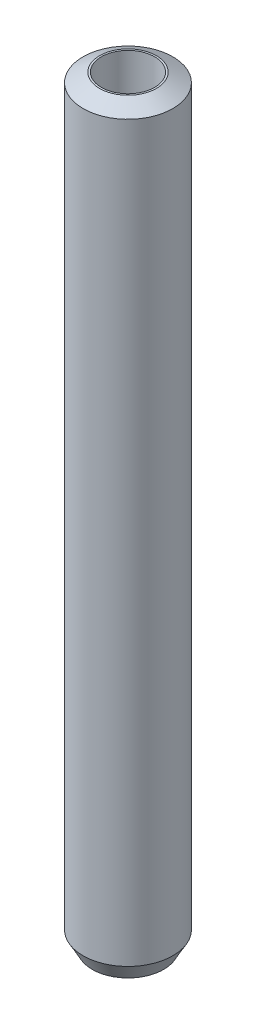
ISO-10303-21;
HEADER;
FILE_DESCRIPTION(('STEP AP214'),'2;1');
FILE_NAME('part.step','',(''),(''),'','','');
FILE_SCHEMA(('AUTOMOTIVE_DESIGN { 1 0 10303 214 1 1 1 1 }'));
ENDSEC;
DATA;
#1=APPLICATION_CONTEXT('core data for automotive mechanical design processes');
#2=APPLICATION_PROTOCOL_DEFINITION('international standard','automotive_design',2000,#1);
#3=PRODUCT_CONTEXT('',#1,'mechanical');
#4=PRODUCT('Part','Part','',(#3));
#5=PRODUCT_RELATED_PRODUCT_CATEGORY('part','',(#4));
#6=PRODUCT_DEFINITION_FORMATION('','',#4);
#7=PRODUCT_DEFINITION_CONTEXT('part definition',#1,'design');
#8=PRODUCT_DEFINITION('design','',#6,#7);
#9=PRODUCT_DEFINITION_SHAPE('','',#8);
#10=(LENGTH_UNIT() NAMED_UNIT(*) SI_UNIT(.MILLI.,.METRE.));
#11=(NAMED_UNIT(*) PLANE_ANGLE_UNIT() SI_UNIT($,.RADIAN.));
#12=(NAMED_UNIT(*) SI_UNIT($,.STERADIAN.) SOLID_ANGLE_UNIT());
#13=UNCERTAINTY_MEASURE_WITH_UNIT(LENGTH_MEASURE(1.E-05),#10,'distance_accuracy_value','');
#14=(GEOMETRIC_REPRESENTATION_CONTEXT(3) GLOBAL_UNCERTAINTY_ASSIGNED_CONTEXT((#13)) GLOBAL_UNIT_ASSIGNED_CONTEXT((#10,
#11,#12)) REPRESENTATION_CONTEXT('',''));
#15=CARTESIAN_POINT('',(0.,0.,0.));
#16=DIRECTION('',(0.,0.,1.));
#17=DIRECTION('',(1.,0.,0.));
#18=AXIS2_PLACEMENT_3D('',#15,#16,#17);
#19=CARTESIAN_POINT('',(0.,422.888548460938,0.));
#20=DIRECTION('',(0.,-1.,0.));
#21=DIRECTION('',(0.,0.,-1.));
#22=AXIS2_PLACEMENT_3D('',#19,#20,#21);
#23=CYLINDRICAL_SURFACE('',#22,25.);
#24=CARTESIAN_POINT('',(0.,417.786648525233,0.));
#25=DIRECTION('',(0.,1.,0.));
#26=DIRECTION('',(0.,0.,1.));
#27=AXIS2_PLACEMENT_3D('',#24,#25,#26);
#28=CIRCLE('',#27,25.);
#29=CARTESIAN_POINT('',(0.,417.786648525233,25.));
#30=VERTEX_POINT('',#29);
#31=EDGE_CURVE('E50',#30,#30,#28,.F.);
#32=ORIENTED_EDGE('',*,*,#31,.T.);
#33=EDGE_LOOP('',(#32));
#34=FACE_BOUND('',#33,.T.);
#35=CARTESIAN_POINT('',(0.,9.17434554495294,0.));
#36=DIRECTION('',(0.,1.,0.));
#37=DIRECTION('',(0.,0.,1.));
#38=AXIS2_PLACEMENT_3D('',#35,#36,#37);
#39=CIRCLE('',#38,25.);
#40=CARTESIAN_POINT('',(0.,9.17434554495294,25.));
#41=VERTEX_POINT('',#40);
#42=EDGE_CURVE('E51',#41,#41,#39,.T.);
#43=ORIENTED_EDGE('',*,*,#42,.T.);
#44=EDGE_LOOP('',(#43));
#45=FACE_BOUND('',#44,.T.);
#46=ADVANCED_FACE('F39',(#34,#45),#23,.T.);
#47=CARTESIAN_POINT('',(0.,422.888548460938,0.));
#48=DIRECTION('',(0.,1.,0.));
#49=DIRECTION('',(0.,0.,1.));
#50=AXIS2_PLACEMENT_3D('',#47,#48,#49);
#51=PLANE('',#50);
#52=CARTESIAN_POINT('',(0.,422.888548460938,0.));
#53=DIRECTION('',(0.,1.,0.));
#54=DIRECTION('',(0.,0.,1.));
#55=AXIS2_PLACEMENT_3D('',#52,#53,#54);
#56=CIRCLE('',#55,15.825654455047);
#57=CARTESIAN_POINT('',(0.,422.888548460938,15.825654455047));
#58=VERTEX_POINT('',#57);
#59=EDGE_CURVE('E54',#58,#58,#56,.T.);
#60=ORIENTED_EDGE('',*,*,#59,.T.);
#61=EDGE_LOOP('',(#60));
#62=FACE_BOUND('',#61,.T.);
#63=CARTESIAN_POINT('',(0.,422.888548460938,0.));
#64=DIRECTION('',(0.,1.,0.));
#65=DIRECTION('',(0.,0.,1.));
#66=AXIS2_PLACEMENT_3D('',#63,#64,#65);
#67=CIRCLE('',#66,14.8225800597742);
#68=CARTESIAN_POINT('',(0.,422.888548460938,14.8225800597742));
#69=VERTEX_POINT('',#68);
#70=EDGE_CURVE('E58',#69,#69,#67,.T.);
#71=ORIENTED_EDGE('',*,*,#70,.F.);
#72=EDGE_LOOP('',(#71));
#73=FACE_BOUND('',#72,.T.);
#74=ADVANCED_FACE('F69',(#62,#73),#51,.T.);
#75=CARTESIAN_POINT('',(0.,0.,0.));
#76=DIRECTION('',(0.,1.,0.));
#77=DIRECTION('',(0.,0.,1.));
#78=AXIS2_PLACEMENT_3D('',#75,#76,#77);
#79=PLANE('',#78);
#80=CARTESIAN_POINT('',(0.,0.,0.));
#81=DIRECTION('',(0.,1.,0.));
#82=DIRECTION('',(0.,0.,1.));
#83=AXIS2_PLACEMENT_3D('',#80,#81,#82);
#84=CIRCLE('',#83,19.8981000642956);
#85=CARTESIAN_POINT('',(0.,0.,19.8981000642956));
#86=VERTEX_POINT('',#85);
#87=EDGE_CURVE('E10',#86,#86,#84,.F.);
#88=ORIENTED_EDGE('',*,*,#87,.T.);
#89=EDGE_LOOP('',(#88));
#90=FACE_BOUND('',#89,.T.);
#91=CARTESIAN_POINT('',(0.,0.,0.));
#92=DIRECTION('',(0.,1.,0.));
#93=DIRECTION('',(0.,0.,1.));
#94=AXIS2_PLACEMENT_3D('',#91,#92,#93);
#95=CIRCLE('',#94,14.8225800597742);
#96=CARTESIAN_POINT('',(0.,0.,14.8225800597742));
#97=VERTEX_POINT('',#96);
#98=EDGE_CURVE('E63',#97,#97,#95,.T.);
#99=ORIENTED_EDGE('',*,*,#98,.T.);
#100=EDGE_LOOP('',(#99));
#101=FACE_BOUND('',#100,.T.);
#102=ADVANCED_FACE('F75',(#90,#101),#79,.F.);
#103=CARTESIAN_POINT('',(0.,422.888548460938,0.));
#104=DIRECTION('',(0.,-1.,0.));
#105=DIRECTION('',(0.,0.,-1.));
#106=AXIS2_PLACEMENT_3D('',#103,#104,#105);
#107=CYLINDRICAL_SURFACE('',#106,14.8225800597742);
#108=ORIENTED_EDGE('',*,*,#70,.T.);
#109=EDGE_LOOP('',(#108));
#110=FACE_BOUND('',#109,.T.);
#111=ORIENTED_EDGE('',*,*,#98,.F.);
#112=EDGE_LOOP('',(#111));
#113=FACE_BOUND('',#112,.T.);
#114=ADVANCED_FACE('F70',(#110,#113),#107,.F.);
#115=CARTESIAN_POINT('',(0.,422.888548460938,0.));
#116=DIRECTION('',(0.,-1.,0.));
#117=DIRECTION('',(0.,0.,-1.));
#118=AXIS2_PLACEMENT_3D('',#115,#116,#117);
#119=CONICAL_SURFACE('',#118,15.825654455047,1.06327801968595);
#120=ORIENTED_EDGE('',*,*,#31,.F.);
#121=EDGE_LOOP('',(#120));
#122=FACE_BOUND('',#121,.T.);
#123=ORIENTED_EDGE('',*,*,#59,.F.);
#124=EDGE_LOOP('',(#123));
#125=FACE_BOUND('',#124,.T.);
#126=ADVANCED_FACE('F81',(#122,#125),#119,.T.);
#127=CARTESIAN_POINT('',(0.,9.17434554495294,0.));
#128=DIRECTION('',(0.,1.,0.));
#129=DIRECTION('',(0.,0.,1.));
#130=AXIS2_PLACEMENT_3D('',#127,#128,#129);
#131=CONICAL_SURFACE('',#130,25.,0.507518307108941);
#132=ORIENTED_EDGE('',*,*,#87,.F.);
#133=EDGE_LOOP('',(#132));
#134=FACE_BOUND('',#133,.T.);
#135=ORIENTED_EDGE('',*,*,#42,.F.);
#136=EDGE_LOOP('',(#135));
#137=FACE_BOUND('',#136,.T.);
#138=ADVANCED_FACE('F45',(#134,#137),#131,.T.);
#139=CLOSED_SHELL('',(#46,#74,#102,#114,#126,#138));
#140=MANIFOLD_SOLID_BREP('B2',#139);
#141=ADVANCED_BREP_SHAPE_REPRESENTATION('',(#18,#140),#14);
#142=SHAPE_DEFINITION_REPRESENTATION(#9,#141);
ENDSEC;
END-ISO-10303-21;
